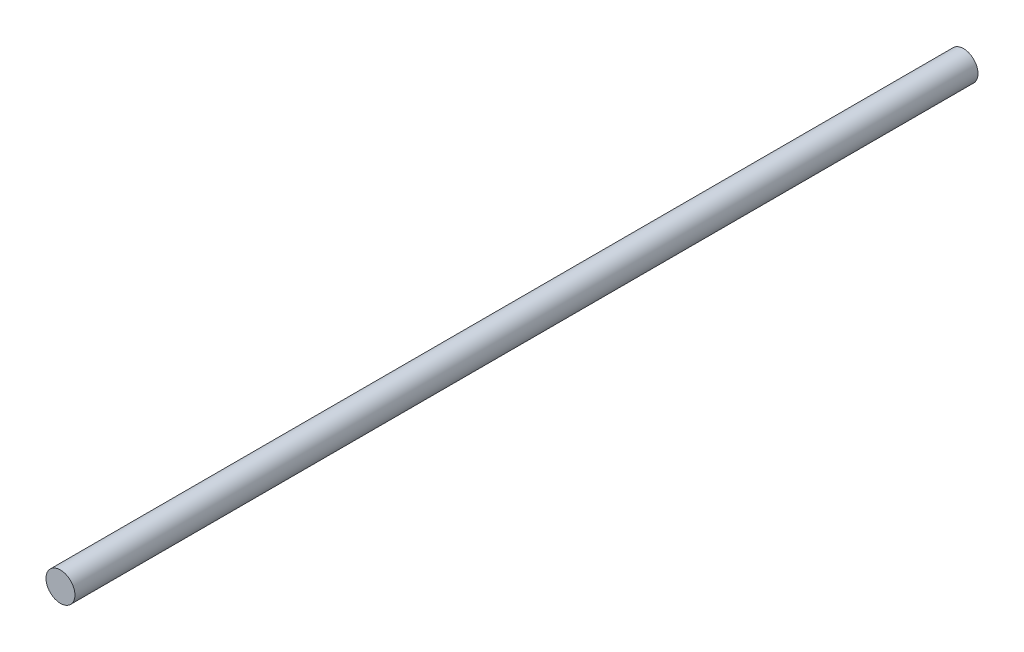
ISO-10303-21;
HEADER;
FILE_DESCRIPTION(('STEP AP214'),'2;1');
FILE_NAME('part.step','',(''),(''),'','','');
FILE_SCHEMA(('AUTOMOTIVE_DESIGN { 1 0 10303 214 1 1 1 1 }'));
ENDSEC;
DATA;
#1=APPLICATION_CONTEXT('core data for automotive mechanical design processes');
#2=APPLICATION_PROTOCOL_DEFINITION('international standard','automotive_design',2000,#1);
#3=PRODUCT_CONTEXT('',#1,'mechanical');
#4=PRODUCT('Part','Part','',(#3));
#5=PRODUCT_RELATED_PRODUCT_CATEGORY('part','',(#4));
#6=PRODUCT_DEFINITION_FORMATION('','',#4);
#7=PRODUCT_DEFINITION_CONTEXT('part definition',#1,'design');
#8=PRODUCT_DEFINITION('design','',#6,#7);
#9=PRODUCT_DEFINITION_SHAPE('','',#8);
#10=(LENGTH_UNIT() NAMED_UNIT(*) SI_UNIT(.MILLI.,.METRE.));
#11=(NAMED_UNIT(*) PLANE_ANGLE_UNIT() SI_UNIT($,.RADIAN.));
#12=(NAMED_UNIT(*) SI_UNIT($,.STERADIAN.) SOLID_ANGLE_UNIT());
#13=UNCERTAINTY_MEASURE_WITH_UNIT(LENGTH_MEASURE(1.E-05),#10,'distance_accuracy_value','');
#14=(GEOMETRIC_REPRESENTATION_CONTEXT(3) GLOBAL_UNCERTAINTY_ASSIGNED_CONTEXT((#13)) GLOBAL_UNIT_ASSIGNED_CONTEXT((#10,
#11,#12)) REPRESENTATION_CONTEXT('',''));
#15=CARTESIAN_POINT('',(0.,0.,0.));
#16=DIRECTION('',(0.,0.,1.));
#17=DIRECTION('',(1.,0.,0.));
#18=AXIS2_PLACEMENT_3D('',#15,#16,#17);
#19=CARTESIAN_POINT('',(0.,0.,39.));
#20=DIRECTION('',(0.,0.,-1.));
#21=DIRECTION('',(-1.,0.,0.));
#22=AXIS2_PLACEMENT_3D('',#19,#20,#21);
#23=CYLINDRICAL_SURFACE('',#22,0.625);
#24=CARTESIAN_POINT('',(0.,0.,39.));
#25=DIRECTION('',(0.,0.,1.));
#26=DIRECTION('',(1.,0.,0.));
#27=AXIS2_PLACEMENT_3D('',#24,#25,#26);
#28=CIRCLE('',#27,0.625);
#29=CARTESIAN_POINT('',(0.625,0.,39.));
#30=VERTEX_POINT('',#29);
#31=EDGE_CURVE('E10',#30,#30,#28,.T.);
#32=ORIENTED_EDGE('',*,*,#31,.F.);
#33=EDGE_LOOP('',(#32));
#34=FACE_BOUND('',#33,.T.);
#35=CARTESIAN_POINT('',(0.,0.,0.));
#36=DIRECTION('',(0.,0.,1.));
#37=DIRECTION('',(1.,0.,0.));
#38=AXIS2_PLACEMENT_3D('',#35,#36,#37);
#39=CIRCLE('',#38,0.625);
#40=CARTESIAN_POINT('',(0.625,0.,0.));
#41=VERTEX_POINT('',#40);
#42=EDGE_CURVE('E40',#41,#41,#39,.T.);
#43=ORIENTED_EDGE('',*,*,#42,.T.);
#44=EDGE_LOOP('',(#43));
#45=FACE_BOUND('',#44,.T.);
#46=ADVANCED_FACE('F37',(#34,#45),#23,.T.);
#47=CARTESIAN_POINT('',(0.,0.,39.));
#48=DIRECTION('',(0.,0.,1.));
#49=DIRECTION('',(1.,0.,0.));
#50=AXIS2_PLACEMENT_3D('',#47,#48,#49);
#51=PLANE('',#50);
#52=ORIENTED_EDGE('',*,*,#31,.T.);
#53=EDGE_LOOP('',(#52));
#54=FACE_BOUND('',#53,.T.);
#55=ADVANCED_FACE('F52',(#54),#51,.T.);
#56=CARTESIAN_POINT('',(0.,0.,0.));
#57=DIRECTION('',(0.,0.,1.));
#58=DIRECTION('',(1.,0.,0.));
#59=AXIS2_PLACEMENT_3D('',#56,#57,#58);
#60=PLANE('',#59);
#61=ORIENTED_EDGE('',*,*,#42,.F.);
#62=EDGE_LOOP('',(#61));
#63=FACE_BOUND('',#62,.T.);
#64=ADVANCED_FACE('F50',(#63),#60,.F.);
#65=CLOSED_SHELL('',(#46,#55,#64));
#66=MANIFOLD_SOLID_BREP('B2',#65);
#67=ADVANCED_BREP_SHAPE_REPRESENTATION('',(#18,#66),#14);
#68=SHAPE_DEFINITION_REPRESENTATION(#9,#67);
ENDSEC;
END-ISO-10303-21;
